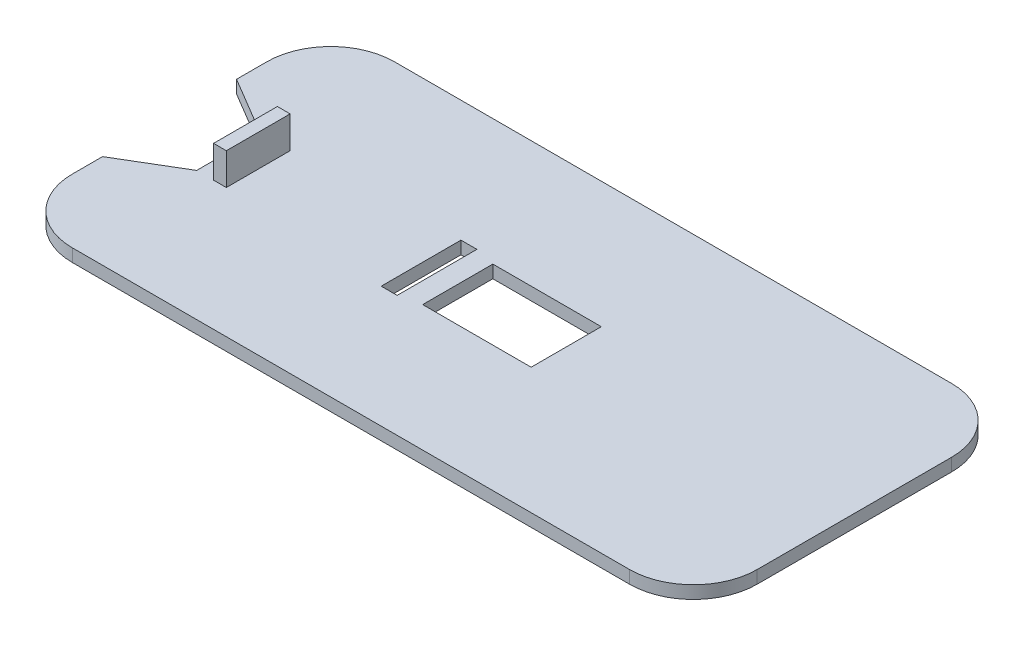
ISO-10303-21;
HEADER;
FILE_DESCRIPTION(('STEP AP214'),'2;1');
FILE_NAME('part.step','',(''),(''),'','','');
FILE_SCHEMA(('AUTOMOTIVE_DESIGN { 1 0 10303 214 1 1 1 1 }'));
ENDSEC;
DATA;
#1=APPLICATION_CONTEXT('core data for automotive mechanical design processes');
#2=APPLICATION_PROTOCOL_DEFINITION('international standard','automotive_design',2000,#1);
#3=PRODUCT_CONTEXT('',#1,'mechanical');
#4=PRODUCT('Part','Part','',(#3));
#5=PRODUCT_RELATED_PRODUCT_CATEGORY('part','',(#4));
#6=PRODUCT_DEFINITION_FORMATION('','',#4);
#7=PRODUCT_DEFINITION_CONTEXT('part definition',#1,'design');
#8=PRODUCT_DEFINITION('design','',#6,#7);
#9=PRODUCT_DEFINITION_SHAPE('','',#8);
#10=(LENGTH_UNIT() NAMED_UNIT(*) SI_UNIT(.MILLI.,.METRE.));
#11=(NAMED_UNIT(*) PLANE_ANGLE_UNIT() SI_UNIT($,.RADIAN.));
#12=(NAMED_UNIT(*) SI_UNIT($,.STERADIAN.) SOLID_ANGLE_UNIT());
#13=UNCERTAINTY_MEASURE_WITH_UNIT(LENGTH_MEASURE(1.E-05),#10,'distance_accuracy_value','');
#14=(GEOMETRIC_REPRESENTATION_CONTEXT(3) GLOBAL_UNCERTAINTY_ASSIGNED_CONTEXT((#13)) GLOBAL_UNIT_ASSIGNED_CONTEXT((#10,
#11,#12)) REPRESENTATION_CONTEXT('',''));
#15=CARTESIAN_POINT('',(0.,0.,0.));
#16=DIRECTION('',(0.,0.,1.));
#17=DIRECTION('',(1.,0.,0.));
#18=AXIS2_PLACEMENT_3D('',#15,#16,#17);
#19=CARTESIAN_POINT('',(0.,4.,0.));
#20=DIRECTION('',(0.,1.,0.));
#21=DIRECTION('',(0.,0.,1.));
#22=AXIS2_PLACEMENT_3D('',#19,#20,#21);
#23=PLANE('',#22);
#24=DIRECTION('',(0.,0.,1.));
#25=VECTOR('',#24,1.);
#26=CARTESIAN_POINT('',(165.120150391339,4.,-118.252283773647));
#27=LINE('',#26,#25);
#28=CARTESIAN_POINT('',(165.120150391339,4.,-143.252283773647));
#29=VERTEX_POINT('',#28);
#30=CARTESIAN_POINT('',(165.120150391339,4.,-118.252283773647));
#31=VERTEX_POINT('',#30);
#32=EDGE_CURVE('E221',#29,#31,#27,.T.);
#33=ORIENTED_EDGE('',*,*,#32,.T.);
#34=DIRECTION('',(-1.,0.,0.));
#35=VECTOR('',#34,1.);
#36=CARTESIAN_POINT('',(160.120150391339,4.,-118.252283773647));
#37=LINE('',#36,#35);
#38=CARTESIAN_POINT('',(160.120150391339,4.,-118.252283773647));
#39=VERTEX_POINT('',#38);
#40=EDGE_CURVE('E230',#31,#39,#37,.T.);
#41=ORIENTED_EDGE('',*,*,#40,.T.);
#42=DIRECTION('',(0.,0.,-1.));
#43=VECTOR('',#42,1.);
#44=CARTESIAN_POINT('',(160.120150391339,4.,-118.252283773647));
#45=LINE('',#44,#43);
#46=CARTESIAN_POINT('',(160.120150391339,4.,-143.252283773647));
#47=VERTEX_POINT('',#46);
#48=EDGE_CURVE('E49',#39,#47,#45,.T.);
#49=ORIENTED_EDGE('',*,*,#48,.T.);
#50=DIRECTION('',(1.,0.,0.));
#51=VECTOR('',#50,1.);
#52=CARTESIAN_POINT('',(160.120150391339,4.,-143.252283773647));
#53=LINE('',#52,#51);
#54=EDGE_CURVE('E227',#47,#29,#53,.T.);
#55=ORIENTED_EDGE('',*,*,#54,.T.);
#56=EDGE_LOOP('',(#33,#41,#49,#55));
#57=FACE_BOUND('',#56,.T.);
#58=DIRECTION('',(-0.859535888020659,0.,-0.511075392877155));
#59=VECTOR('',#58,1.);
#60=CARTESIAN_POINT('',(99.770150391339,4.,-140.752283773647));
#61=LINE('',#60,#59);
#62=CARTESIAN_POINT('',(99.770150391339,4.,-140.752283773647));
#63=VERTEX_POINT('',#62);
#64=CARTESIAN_POINT('',(81.270150391339,4.,-151.752283773647));
#65=VERTEX_POINT('',#64);
#66=EDGE_CURVE('E302',#63,#65,#61,.T.);
#67=ORIENTED_EDGE('',*,*,#66,.F.);
#68=DIRECTION('',(0.,0.,-1.));
#69=VECTOR('',#68,1.);
#70=CARTESIAN_POINT('',(99.770150391339,4.,-120.752283773647));
#71=LINE('',#70,#69);
#72=CARTESIAN_POINT('',(99.770150391339,4.,-120.752283773647));
#73=VERTEX_POINT('',#72);
#74=EDGE_CURVE('E307',#73,#63,#71,.T.);
#75=ORIENTED_EDGE('',*,*,#74,.F.);
#76=DIRECTION('',(0.859535888020664,0.,-0.511075392877145));
#77=VECTOR('',#76,1.);
#78=CARTESIAN_POINT('',(81.270150391339,4.,-109.752283773647));
#79=LINE('',#78,#77);
#80=CARTESIAN_POINT('',(81.270150391339,4.,-109.752283773647));
#81=VERTEX_POINT('',#80);
#82=EDGE_CURVE('E315',#81,#73,#79,.T.);
#83=ORIENTED_EDGE('',*,*,#82,.F.);
#84=DIRECTION('',(0.,0.,1.));
#85=VECTOR('',#84,1.);
#86=CARTESIAN_POINT('',(81.270150391339,4.,0.));
#87=LINE('',#86,#85);
#88=CARTESIAN_POINT('',(81.270150391339,4.,-100.252283773648));
#89=VERTEX_POINT('',#88);
#90=EDGE_CURVE('E373',#81,#89,#87,.T.);
#91=ORIENTED_EDGE('',*,*,#90,.T.);
#92=CARTESIAN_POINT('',(101.270150391339,4.,-100.252283773647));
#93=DIRECTION('',(0.,1.,0.));
#94=DIRECTION('',(0.,0.,1.));
#95=AXIS2_PLACEMENT_3D('',#92,#93,#94);
#96=CIRCLE('',#95,20.);
#97=CARTESIAN_POINT('',(101.270150391339,4.,-80.2522837736474));
#98=VERTEX_POINT('',#97);
#99=EDGE_CURVE('E377',#89,#98,#96,.T.);
#100=ORIENTED_EDGE('',*,*,#99,.T.);
#101=DIRECTION('',(1.,0.,0.));
#102=VECTOR('',#101,1.);
#103=CARTESIAN_POINT('',(0.,4.,-80.2522837736474));
#104=LINE('',#103,#102);
#105=CARTESIAN_POINT('',(275.970150391339,4.,-80.2522837736474));
#106=VERTEX_POINT('',#105);
#107=EDGE_CURVE('E379',#98,#106,#104,.T.);
#108=ORIENTED_EDGE('',*,*,#107,.T.);
#109=CARTESIAN_POINT('',(275.970150391339,4.,-100.252283773647));
#110=DIRECTION('',(0.,1.,0.));
#111=DIRECTION('',(0.,0.,1.));
#112=AXIS2_PLACEMENT_3D('',#109,#110,#111);
#113=CIRCLE('',#112,20.);
#114=CARTESIAN_POINT('',(295.970150391339,4.,-100.252283773647));
#115=VERTEX_POINT('',#114);
#116=EDGE_CURVE('E381',#106,#115,#113,.T.);
#117=ORIENTED_EDGE('',*,*,#116,.T.);
#118=DIRECTION('',(0.,0.,1.));
#119=VECTOR('',#118,1.);
#120=CARTESIAN_POINT('',(295.970150391339,4.,0.));
#121=LINE('',#120,#119);
#122=CARTESIAN_POINT('',(295.970150391339,4.,-161.252283773647));
#123=VERTEX_POINT('',#122);
#124=EDGE_CURVE('E361',#123,#115,#121,.T.);
#125=ORIENTED_EDGE('',*,*,#124,.F.);
#126=CARTESIAN_POINT('',(275.970150391339,4.,-161.252283773647));
#127=DIRECTION('',(0.,1.,0.));
#128=DIRECTION('',(0.,0.,1.));
#129=AXIS2_PLACEMENT_3D('',#126,#127,#128);
#130=CIRCLE('',#129,20.);
#131=CARTESIAN_POINT('',(275.970150391339,4.,-181.252283773647));
#132=VERTEX_POINT('',#131);
#133=EDGE_CURVE('E364',#132,#123,#130,.F.);
#134=ORIENTED_EDGE('',*,*,#133,.F.);
#135=DIRECTION('',(1.,0.,0.));
#136=VECTOR('',#135,1.);
#137=CARTESIAN_POINT('',(0.,4.,-181.252283773647));
#138=LINE('',#137,#136);
#139=CARTESIAN_POINT('',(101.270150391339,4.,-181.252283773647));
#140=VERTEX_POINT('',#139);
#141=EDGE_CURVE('E368',#140,#132,#138,.T.);
#142=ORIENTED_EDGE('',*,*,#141,.F.);
#143=CARTESIAN_POINT('',(101.270150391339,4.,-161.252283773647));
#144=DIRECTION('',(0.,1.,0.));
#145=DIRECTION('',(0.,0.,1.));
#146=AXIS2_PLACEMENT_3D('',#143,#144,#145);
#147=CIRCLE('',#146,20.);
#148=CARTESIAN_POINT('',(81.270150391339,4.,-161.252283773647));
#149=VERTEX_POINT('',#148);
#150=EDGE_CURVE('E371',#140,#149,#147,.T.);
#151=ORIENTED_EDGE('',*,*,#150,.T.);
#152=EDGE_CURVE('E374',#149,#65,#87,.T.);
#153=ORIENTED_EDGE('',*,*,#152,.T.);
#154=EDGE_LOOP('',(#67,#75,#83,#91,#100,#108,#117,#125,#134,#142,#151,#153));
#155=FACE_BOUND('',#154,.T.);
#156=DIRECTION('',(0.,0.,1.));
#157=VECTOR('',#156,1.);
#158=CARTESIAN_POINT('',(171.620150391339,4.,-141.752283773647));
#159=LINE('',#158,#157);
#160=CARTESIAN_POINT('',(171.620150391339,4.,-141.752283773647));
#161=VERTEX_POINT('',#160);
#162=CARTESIAN_POINT('',(171.620150391339,4.,-119.752283773647));
#163=VERTEX_POINT('',#162);
#164=EDGE_CURVE('E332',#161,#163,#159,.T.);
#165=ORIENTED_EDGE('',*,*,#164,.F.);
#166=DIRECTION('',(1.,0.,0.));
#167=VECTOR('',#166,1.);
#168=CARTESIAN_POINT('',(171.620150391339,4.,-141.752283773647));
#169=LINE('',#168,#167);
#170=CARTESIAN_POINT('',(205.620150391339,4.,-141.752283773647));
#171=VERTEX_POINT('',#170);
#172=EDGE_CURVE('E322',#161,#171,#169,.T.);
#173=ORIENTED_EDGE('',*,*,#172,.T.);
#174=DIRECTION('',(0.,0.,1.));
#175=VECTOR('',#174,1.);
#176=CARTESIAN_POINT('',(205.620150391339,4.,-141.752283773647));
#177=LINE('',#176,#175);
#178=CARTESIAN_POINT('',(205.620150391339,4.,-119.752283773647));
#179=VERTEX_POINT('',#178);
#180=EDGE_CURVE('E343',#171,#179,#177,.T.);
#181=ORIENTED_EDGE('',*,*,#180,.T.);
#182=DIRECTION('',(1.,0.,0.));
#183=VECTOR('',#182,1.);
#184=CARTESIAN_POINT('',(171.620150391339,4.,-119.752283773647));
#185=LINE('',#184,#183);
#186=EDGE_CURVE('E346',#163,#179,#185,.T.);
#187=ORIENTED_EDGE('',*,*,#186,.F.);
#188=EDGE_LOOP('',(#165,#173,#181,#187));
#189=FACE_BOUND('',#188,.T.);
#190=DIRECTION('',(1.,0.,0.));
#191=VECTOR('',#190,1.);
#192=CARTESIAN_POINT('',(0.,4.,-140.752283773647));
#193=LINE('',#192,#191);
#194=CARTESIAN_POINT('',(105.070150391339,4.,-140.752283773647));
#195=VERTEX_POINT('',#194);
#196=CARTESIAN_POINT('',(109.070150391339,4.,-140.752283773647));
#197=VERTEX_POINT('',#196);
#198=EDGE_CURVE('E296',#195,#197,#193,.T.);
#199=ORIENTED_EDGE('',*,*,#198,.T.);
#200=DIRECTION('',(0.,0.,1.));
#201=VECTOR('',#200,1.);
#202=CARTESIAN_POINT('',(109.070150391339,4.,0.));
#203=LINE('',#202,#201);
#204=CARTESIAN_POINT('',(109.070150391339,4.,-120.752283773647));
#205=VERTEX_POINT('',#204);
#206=EDGE_CURVE('E299',#197,#205,#203,.T.);
#207=ORIENTED_EDGE('',*,*,#206,.T.);
#208=DIRECTION('',(-1.,0.,0.));
#209=VECTOR('',#208,1.);
#210=CARTESIAN_POINT('',(0.,4.,-120.752283773647));
#211=LINE('',#210,#209);
#212=CARTESIAN_POINT('',(105.070150391339,4.,-120.752283773647));
#213=VERTEX_POINT('',#212);
#214=EDGE_CURVE('E290',#205,#213,#211,.T.);
#215=ORIENTED_EDGE('',*,*,#214,.T.);
#216=DIRECTION('',(0.,0.,-1.));
#217=VECTOR('',#216,1.);
#218=CARTESIAN_POINT('',(105.070150391339,4.,0.));
#219=LINE('',#218,#217);
#220=EDGE_CURVE('E293',#213,#195,#219,.T.);
#221=ORIENTED_EDGE('',*,*,#220,.T.);
#222=EDGE_LOOP('',(#199,#207,#215,#221));
#223=FACE_BOUND('',#222,.T.);
#224=ADVANCED_FACE('F34',(#57,#155,#189,#223),#23,.T.);
#225=CARTESIAN_POINT('',(0.,0.,0.));
#226=DIRECTION('',(0.,1.,0.));
#227=DIRECTION('',(0.,0.,1.));
#228=AXIS2_PLACEMENT_3D('',#225,#226,#227);
#229=PLANE('',#228);
#230=DIRECTION('',(-1.,0.,0.));
#231=VECTOR('',#230,1.);
#232=CARTESIAN_POINT('',(160.120150391339,0.,-118.252283773647));
#233=LINE('',#232,#231);
#234=CARTESIAN_POINT('',(165.120150391339,0.,-118.252283773647));
#235=VERTEX_POINT('',#234);
#236=CARTESIAN_POINT('',(160.120150391339,0.,-118.252283773647));
#237=VERTEX_POINT('',#236);
#238=EDGE_CURVE('E245',#235,#237,#233,.T.);
#239=ORIENTED_EDGE('',*,*,#238,.F.);
#240=DIRECTION('',(0.,0.,1.));
#241=VECTOR('',#240,1.);
#242=CARTESIAN_POINT('',(165.120150391339,0.,-118.252283773647));
#243=LINE('',#242,#241);
#244=CARTESIAN_POINT('',(165.120150391339,0.,-143.252283773647));
#245=VERTEX_POINT('',#244);
#246=EDGE_CURVE('E57',#245,#235,#243,.T.);
#247=ORIENTED_EDGE('',*,*,#246,.F.);
#248=DIRECTION('',(1.,0.,0.));
#249=VECTOR('',#248,1.);
#250=CARTESIAN_POINT('',(160.120150391339,0.,-143.252283773647));
#251=LINE('',#250,#249);
#252=CARTESIAN_POINT('',(160.120150391339,0.,-143.252283773647));
#253=VERTEX_POINT('',#252);
#254=EDGE_CURVE('E236',#253,#245,#251,.T.);
#255=ORIENTED_EDGE('',*,*,#254,.F.);
#256=DIRECTION('',(0.,0.,-1.));
#257=VECTOR('',#256,1.);
#258=CARTESIAN_POINT('',(160.120150391339,0.,-118.252283773647));
#259=LINE('',#258,#257);
#260=EDGE_CURVE('E239',#237,#253,#259,.T.);
#261=ORIENTED_EDGE('',*,*,#260,.F.);
#262=EDGE_LOOP('',(#239,#247,#255,#261));
#263=FACE_BOUND('',#262,.T.);
#264=DIRECTION('',(1.,0.,0.));
#265=VECTOR('',#264,1.);
#266=CARTESIAN_POINT('',(171.620150391339,0.,-141.752283773647));
#267=LINE('',#266,#265);
#268=CARTESIAN_POINT('',(171.620150391339,0.,-141.752283773647));
#269=VERTEX_POINT('',#268);
#270=CARTESIAN_POINT('',(205.620150391339,0.,-141.752283773647));
#271=VERTEX_POINT('',#270);
#272=EDGE_CURVE('E329',#269,#271,#267,.T.);
#273=ORIENTED_EDGE('',*,*,#272,.F.);
#274=DIRECTION('',(0.,0.,1.));
#275=VECTOR('',#274,1.);
#276=CARTESIAN_POINT('',(171.620150391339,0.,-141.752283773647));
#277=LINE('',#276,#275);
#278=CARTESIAN_POINT('',(171.620150391339,0.,-119.752283773647));
#279=VERTEX_POINT('',#278);
#280=EDGE_CURVE('E337',#269,#279,#277,.T.);
#281=ORIENTED_EDGE('',*,*,#280,.T.);
#282=DIRECTION('',(1.,0.,0.));
#283=VECTOR('',#282,1.);
#284=CARTESIAN_POINT('',(171.620150391339,0.,-119.752283773647));
#285=LINE('',#284,#283);
#286=CARTESIAN_POINT('',(205.620150391339,0.,-119.752283773647));
#287=VERTEX_POINT('',#286);
#288=EDGE_CURVE('E334',#279,#287,#285,.T.);
#289=ORIENTED_EDGE('',*,*,#288,.T.);
#290=DIRECTION('',(0.,0.,1.));
#291=VECTOR('',#290,1.);
#292=CARTESIAN_POINT('',(205.620150391339,0.,-141.752283773647));
#293=LINE('',#292,#291);
#294=EDGE_CURVE('E331',#271,#287,#293,.T.);
#295=ORIENTED_EDGE('',*,*,#294,.F.);
#296=EDGE_LOOP('',(#273,#281,#289,#295));
#297=FACE_BOUND('',#296,.T.);
#298=DIRECTION('',(0.,0.,-1.));
#299=VECTOR('',#298,1.);
#300=CARTESIAN_POINT('',(99.770150391339,0.,-120.752283773647));
#301=LINE('',#300,#299);
#302=CARTESIAN_POINT('',(99.770150391339,0.,-120.752283773647));
#303=VERTEX_POINT('',#302);
#304=CARTESIAN_POINT('',(99.770150391339,0.,-140.752283773647));
#305=VERTEX_POINT('',#304);
#306=EDGE_CURVE('E310',#303,#305,#301,.T.);
#307=ORIENTED_EDGE('',*,*,#306,.T.);
#308=DIRECTION('',(-0.859535888020659,0.,-0.511075392877155));
#309=VECTOR('',#308,1.);
#310=CARTESIAN_POINT('',(99.770150391339,0.,-140.752283773647));
#311=LINE('',#310,#309);
#312=CARTESIAN_POINT('',(81.270150391339,0.,-151.752283773647));
#313=VERTEX_POINT('',#312);
#314=EDGE_CURVE('E303',#305,#313,#311,.T.);
#315=ORIENTED_EDGE('',*,*,#314,.T.);
#316=DIRECTION('',(0.,0.,1.));
#317=VECTOR('',#316,1.);
#318=CARTESIAN_POINT('',(81.270150391339,0.,0.));
#319=LINE('',#318,#317);
#320=CARTESIAN_POINT('',(81.270150391339,0.,-161.252283773647));
#321=VERTEX_POINT('',#320);
#322=EDGE_CURVE('E395',#321,#313,#319,.T.);
#323=ORIENTED_EDGE('',*,*,#322,.F.);
#324=CARTESIAN_POINT('',(101.270150391339,0.,-161.252283773647));
#325=DIRECTION('',(0.,1.,0.));
#326=DIRECTION('',(0.,0.,1.));
#327=AXIS2_PLACEMENT_3D('',#324,#325,#326);
#328=CIRCLE('',#327,20.);
#329=CARTESIAN_POINT('',(101.270150391339,0.,-181.252283773647));
#330=VERTEX_POINT('',#329);
#331=EDGE_CURVE('E392',#330,#321,#328,.T.);
#332=ORIENTED_EDGE('',*,*,#331,.F.);
#333=DIRECTION('',(1.,0.,0.));
#334=VECTOR('',#333,1.);
#335=CARTESIAN_POINT('',(0.,0.,-181.252283773647));
#336=LINE('',#335,#334);
#337=CARTESIAN_POINT('',(275.970150391339,0.,-181.252283773647));
#338=VERTEX_POINT('',#337);
#339=EDGE_CURVE('E389',#330,#338,#336,.T.);
#340=ORIENTED_EDGE('',*,*,#339,.T.);
#341=CARTESIAN_POINT('',(275.970150391339,0.,-161.252283773647));
#342=DIRECTION('',(0.,1.,0.));
#343=DIRECTION('',(0.,0.,1.));
#344=AXIS2_PLACEMENT_3D('',#341,#342,#343);
#345=CIRCLE('',#344,20.);
#346=CARTESIAN_POINT('',(295.970150391339,0.,-161.252283773647));
#347=VERTEX_POINT('',#346);
#348=EDGE_CURVE('E386',#338,#347,#345,.F.);
#349=ORIENTED_EDGE('',*,*,#348,.T.);
#350=DIRECTION('',(0.,0.,1.));
#351=VECTOR('',#350,1.);
#352=CARTESIAN_POINT('',(295.970150391339,0.,0.));
#353=LINE('',#352,#351);
#354=CARTESIAN_POINT('',(295.970150391339,0.,-100.252283773647));
#355=VERTEX_POINT('',#354);
#356=EDGE_CURVE('E360',#347,#355,#353,.T.);
#357=ORIENTED_EDGE('',*,*,#356,.T.);
#358=CARTESIAN_POINT('',(275.970150391339,0.,-100.252283773647));
#359=DIRECTION('',(0.,1.,0.));
#360=DIRECTION('',(0.,0.,1.));
#361=AXIS2_PLACEMENT_3D('',#358,#359,#360);
#362=CIRCLE('',#361,20.);
#363=CARTESIAN_POINT('',(275.970150391339,0.,-80.2522837736474));
#364=VERTEX_POINT('',#363);
#365=EDGE_CURVE('E365',#364,#355,#362,.T.);
#366=ORIENTED_EDGE('',*,*,#365,.F.);
#367=DIRECTION('',(1.,0.,0.));
#368=VECTOR('',#367,1.);
#369=CARTESIAN_POINT('',(0.,0.,-80.2522837736474));
#370=LINE('',#369,#368);
#371=CARTESIAN_POINT('',(101.270150391339,0.,-80.2522837736474));
#372=VERTEX_POINT('',#371);
#373=EDGE_CURVE('E400',#372,#364,#370,.T.);
#374=ORIENTED_EDGE('',*,*,#373,.F.);
#375=CARTESIAN_POINT('',(101.270150391339,0.,-100.252283773647));
#376=DIRECTION('',(0.,1.,0.));
#377=DIRECTION('',(0.,0.,1.));
#378=AXIS2_PLACEMENT_3D('',#375,#376,#377);
#379=CIRCLE('',#378,20.);
#380=CARTESIAN_POINT('',(81.270150391339,0.,-100.252283773648));
#381=VERTEX_POINT('',#380);
#382=EDGE_CURVE('E398',#381,#372,#379,.T.);
#383=ORIENTED_EDGE('',*,*,#382,.F.);
#384=CARTESIAN_POINT('',(81.270150391339,0.,-109.752283773647));
#385=VERTEX_POINT('',#384);
#386=EDGE_CURVE('E394',#385,#381,#319,.T.);
#387=ORIENTED_EDGE('',*,*,#386,.F.);
#388=DIRECTION('',(0.859535888020664,0.,-0.511075392877145));
#389=VECTOR('',#388,1.);
#390=CARTESIAN_POINT('',(81.270150391339,0.,-109.752283773647));
#391=LINE('',#390,#389);
#392=EDGE_CURVE('E306',#385,#303,#391,.T.);
#393=ORIENTED_EDGE('',*,*,#392,.T.);
#394=EDGE_LOOP('',(#307,#315,#323,#332,#340,#349,#357,#366,#374,#383,#387,#393));
#395=FACE_BOUND('',#394,.T.);
#396=DIRECTION('',(0.,0.,1.));
#397=VECTOR('',#396,1.);
#398=CARTESIAN_POINT('',(109.070150391339,0.,0.));
#399=LINE('',#398,#397);
#400=CARTESIAN_POINT('',(109.070150391339,0.,-140.752283773647));
#401=VERTEX_POINT('',#400);
#402=CARTESIAN_POINT('',(109.070150391339,0.,-120.752283773647));
#403=VERTEX_POINT('',#402);
#404=EDGE_CURVE('E11',#401,#403,#399,.T.);
#405=ORIENTED_EDGE('',*,*,#404,.F.);
#406=DIRECTION('',(1.,0.,0.));
#407=VECTOR('',#406,1.);
#408=CARTESIAN_POINT('',(0.,0.,-140.752283773647));
#409=LINE('',#408,#407);
#410=CARTESIAN_POINT('',(105.070150391339,0.,-140.752283773647));
#411=VERTEX_POINT('',#410);
#412=EDGE_CURVE('E42',#411,#401,#409,.T.);
#413=ORIENTED_EDGE('',*,*,#412,.F.);
#414=DIRECTION('',(0.,0.,-1.));
#415=VECTOR('',#414,1.);
#416=CARTESIAN_POINT('',(105.070150391339,0.,0.));
#417=LINE('',#416,#415);
#418=CARTESIAN_POINT('',(105.070150391339,0.,-120.752283773647));
#419=VERTEX_POINT('',#418);
#420=EDGE_CURVE('E426',#419,#411,#417,.T.);
#421=ORIENTED_EDGE('',*,*,#420,.F.);
#422=DIRECTION('',(-1.,0.,0.));
#423=VECTOR('',#422,1.);
#424=CARTESIAN_POINT('',(0.,0.,-120.752283773647));
#425=LINE('',#424,#423);
#426=EDGE_CURVE('E423',#403,#419,#425,.T.);
#427=ORIENTED_EDGE('',*,*,#426,.F.);
#428=EDGE_LOOP('',(#405,#413,#421,#427));
#429=FACE_BOUND('',#428,.T.);
#430=ADVANCED_FACE('F448',(#263,#297,#395,#429),#229,.F.);
#431=CARTESIAN_POINT('',(81.270150391339,4.,0.));
#432=DIRECTION('',(1.,0.,0.));
#433=DIRECTION('',(0.,0.,-1.));
#434=AXIS2_PLACEMENT_3D('',#431,#432,#433);
#435=PLANE('',#434);
#436=ORIENTED_EDGE('',*,*,#322,.T.);
#437=DIRECTION('',(0.,1.,0.));
#438=VECTOR('',#437,1.);
#439=CARTESIAN_POINT('',(81.270150391339,0.,-151.752283773647));
#440=LINE('',#439,#438);
#441=EDGE_CURVE('E313',#313,#65,#440,.T.);
#442=ORIENTED_EDGE('',*,*,#441,.T.);
#443=ORIENTED_EDGE('',*,*,#152,.F.);
#444=DIRECTION('',(0.,-1.,0.));
#445=VECTOR('',#444,1.);
#446=CARTESIAN_POINT('',(81.270150391339,4.,-161.252283773647));
#447=LINE('',#446,#445);
#448=EDGE_CURVE('E414',#149,#321,#447,.T.);
#449=ORIENTED_EDGE('',*,*,#448,.T.);
#450=EDGE_LOOP('',(#436,#442,#443,#449));
#451=FACE_BOUND('',#450,.T.);
#452=ADVANCED_FACE('F450',(#451),#435,.F.);
#453=CARTESIAN_POINT('',(295.970150391339,4.,0.));
#454=DIRECTION('',(1.,0.,0.));
#455=DIRECTION('',(0.,0.,-1.));
#456=AXIS2_PLACEMENT_3D('',#453,#454,#455);
#457=PLANE('',#456);
#458=ORIENTED_EDGE('',*,*,#356,.F.);
#459=DIRECTION('',(0.,-1.,0.));
#460=VECTOR('',#459,1.);
#461=CARTESIAN_POINT('',(295.970150391339,4.,-161.252283773647));
#462=LINE('',#461,#460);
#463=EDGE_CURVE('E421',#123,#347,#462,.T.);
#464=ORIENTED_EDGE('',*,*,#463,.F.);
#465=ORIENTED_EDGE('',*,*,#124,.T.);
#466=DIRECTION('',(0.,-1.,0.));
#467=VECTOR('',#466,1.);
#468=CARTESIAN_POINT('',(295.970150391339,4.,-100.252283773647));
#469=LINE('',#468,#467);
#470=EDGE_CURVE('E383',#115,#355,#469,.T.);
#471=ORIENTED_EDGE('',*,*,#470,.T.);
#472=EDGE_LOOP('',(#458,#464,#465,#471));
#473=FACE_BOUND('',#472,.T.);
#474=ADVANCED_FACE('F36',(#473),#457,.T.);
#475=CARTESIAN_POINT('',(275.970150391339,4.,-161.252283773647));
#476=DIRECTION('',(0.,-1.,0.));
#477=DIRECTION('',(0.,0.,-1.));
#478=AXIS2_PLACEMENT_3D('',#475,#476,#477);
#479=CYLINDRICAL_SURFACE('',#478,20.);
#480=ORIENTED_EDGE('',*,*,#348,.F.);
#481=DIRECTION('',(0.,-1.,0.));
#482=VECTOR('',#481,1.);
#483=CARTESIAN_POINT('',(275.970150391339,4.,-181.252283773647));
#484=LINE('',#483,#482);
#485=EDGE_CURVE('E419',#132,#338,#484,.T.);
#486=ORIENTED_EDGE('',*,*,#485,.F.);
#487=ORIENTED_EDGE('',*,*,#133,.T.);
#488=ORIENTED_EDGE('',*,*,#463,.T.);
#489=EDGE_LOOP('',(#480,#486,#487,#488));
#490=FACE_BOUND('',#489,.T.);
#491=ADVANCED_FACE('F485',(#490),#479,.T.);
#492=CARTESIAN_POINT('',(0.,4.,-181.252283773647));
#493=DIRECTION('',(0.,0.,-1.));
#494=DIRECTION('',(-1.,0.,0.));
#495=AXIS2_PLACEMENT_3D('',#492,#493,#494);
#496=PLANE('',#495);
#497=ORIENTED_EDGE('',*,*,#339,.F.);
#498=DIRECTION('',(0.,-1.,0.));
#499=VECTOR('',#498,1.);
#500=CARTESIAN_POINT('',(101.270150391339,4.,-181.252283773647));
#501=LINE('',#500,#499);
#502=EDGE_CURVE('E417',#140,#330,#501,.T.);
#503=ORIENTED_EDGE('',*,*,#502,.F.);
#504=ORIENTED_EDGE('',*,*,#141,.T.);
#505=ORIENTED_EDGE('',*,*,#485,.T.);
#506=EDGE_LOOP('',(#497,#503,#504,#505));
#507=FACE_BOUND('',#506,.T.);
#508=ADVANCED_FACE('F482',(#507),#496,.T.);
#509=CARTESIAN_POINT('',(101.270150391339,4.,-161.252283773647));
#510=DIRECTION('',(0.,-1.,0.));
#511=DIRECTION('',(0.,0.,-1.));
#512=AXIS2_PLACEMENT_3D('',#509,#510,#511);
#513=CYLINDRICAL_SURFACE('',#512,20.);
#514=ORIENTED_EDGE('',*,*,#331,.T.);
#515=ORIENTED_EDGE('',*,*,#448,.F.);
#516=ORIENTED_EDGE('',*,*,#150,.F.);
#517=ORIENTED_EDGE('',*,*,#502,.T.);
#518=EDGE_LOOP('',(#514,#515,#516,#517));
#519=FACE_BOUND('',#518,.T.);
#520=ADVANCED_FACE('F478',(#519),#513,.T.);
#521=ORIENTED_EDGE('',*,*,#90,.F.);
#522=DIRECTION('',(0.,1.,0.));
#523=VECTOR('',#522,1.);
#524=CARTESIAN_POINT('',(81.270150391339,0.,-109.752283773647));
#525=LINE('',#524,#523);
#526=EDGE_CURVE('E325',#385,#81,#525,.T.);
#527=ORIENTED_EDGE('',*,*,#526,.F.);
#528=ORIENTED_EDGE('',*,*,#386,.T.);
#529=DIRECTION('',(0.,-1.,0.));
#530=VECTOR('',#529,1.);
#531=CARTESIAN_POINT('',(81.270150391339,4.,-100.252283773648));
#532=LINE('',#531,#530);
#533=EDGE_CURVE('E411',#89,#381,#532,.T.);
#534=ORIENTED_EDGE('',*,*,#533,.F.);
#535=EDGE_LOOP('',(#521,#527,#528,#534));
#536=FACE_BOUND('',#535,.T.);
#537=ADVANCED_FACE('F459',(#536),#435,.F.);
#538=CARTESIAN_POINT('',(101.270150391339,4.,-100.252283773647));
#539=DIRECTION('',(0.,-1.,0.));
#540=DIRECTION('',(0.,0.,-1.));
#541=AXIS2_PLACEMENT_3D('',#538,#539,#540);
#542=CYLINDRICAL_SURFACE('',#541,20.);
#543=ORIENTED_EDGE('',*,*,#382,.T.);
#544=DIRECTION('',(0.,-1.,0.));
#545=VECTOR('',#544,1.);
#546=CARTESIAN_POINT('',(101.270150391339,4.,-80.2522837736474));
#547=LINE('',#546,#545);
#548=EDGE_CURVE('E408',#98,#372,#547,.T.);
#549=ORIENTED_EDGE('',*,*,#548,.F.);
#550=ORIENTED_EDGE('',*,*,#99,.F.);
#551=ORIENTED_EDGE('',*,*,#533,.T.);
#552=EDGE_LOOP('',(#543,#549,#550,#551));
#553=FACE_BOUND('',#552,.T.);
#554=ADVANCED_FACE('F472',(#553),#542,.T.);
#555=CARTESIAN_POINT('',(0.,4.,-80.2522837736474));
#556=DIRECTION('',(0.,0.,-1.));
#557=DIRECTION('',(-1.,0.,0.));
#558=AXIS2_PLACEMENT_3D('',#555,#556,#557);
#559=PLANE('',#558);
#560=ORIENTED_EDGE('',*,*,#373,.T.);
#561=DIRECTION('',(0.,-1.,0.));
#562=VECTOR('',#561,1.);
#563=CARTESIAN_POINT('',(275.970150391339,4.,-80.2522837736474));
#564=LINE('',#563,#562);
#565=EDGE_CURVE('E405',#106,#364,#564,.T.);
#566=ORIENTED_EDGE('',*,*,#565,.F.);
#567=ORIENTED_EDGE('',*,*,#107,.F.);
#568=ORIENTED_EDGE('',*,*,#548,.T.);
#569=EDGE_LOOP('',(#560,#566,#567,#568));
#570=FACE_BOUND('',#569,.T.);
#571=ADVANCED_FACE('F468',(#570),#559,.F.);
#572=CARTESIAN_POINT('',(275.970150391339,4.,-100.252283773647));
#573=DIRECTION('',(0.,-1.,0.));
#574=DIRECTION('',(0.,0.,-1.));
#575=AXIS2_PLACEMENT_3D('',#572,#573,#574);
#576=CYLINDRICAL_SURFACE('',#575,20.);
#577=ORIENTED_EDGE('',*,*,#365,.T.);
#578=ORIENTED_EDGE('',*,*,#470,.F.);
#579=ORIENTED_EDGE('',*,*,#116,.F.);
#580=ORIENTED_EDGE('',*,*,#565,.T.);
#581=EDGE_LOOP('',(#577,#578,#579,#580));
#582=FACE_BOUND('',#581,.T.);
#583=ADVANCED_FACE('F464',(#582),#576,.T.);
#584=CARTESIAN_POINT('',(171.620150391339,0.,-141.752283773647));
#585=DIRECTION('',(0.,0.,1.));
#586=DIRECTION('',(1.,0.,0.));
#587=AXIS2_PLACEMENT_3D('',#584,#585,#586);
#588=PLANE('',#587);
#589=ORIENTED_EDGE('',*,*,#172,.F.);
#590=DIRECTION('',(0.,1.,0.));
#591=VECTOR('',#590,1.);
#592=CARTESIAN_POINT('',(171.620150391339,0.,-141.752283773647));
#593=LINE('',#592,#591);
#594=EDGE_CURVE('E340',#269,#161,#593,.T.);
#595=ORIENTED_EDGE('',*,*,#594,.F.);
#596=ORIENTED_EDGE('',*,*,#272,.T.);
#597=DIRECTION('',(0.,1.,0.));
#598=VECTOR('',#597,1.);
#599=CARTESIAN_POINT('',(205.620150391339,0.,-141.752283773647));
#600=LINE('',#599,#598);
#601=EDGE_CURVE('E357',#271,#171,#600,.T.);
#602=ORIENTED_EDGE('',*,*,#601,.T.);
#603=EDGE_LOOP('',(#589,#595,#596,#602));
#604=FACE_BOUND('',#603,.T.);
#605=ADVANCED_FACE('F467',(#604),#588,.T.);
#606=CARTESIAN_POINT('',(205.620150391339,0.,-141.752283773647));
#607=DIRECTION('',(-1.,0.,0.));
#608=DIRECTION('',(0.,0.,1.));
#609=AXIS2_PLACEMENT_3D('',#606,#607,#608);
#610=PLANE('',#609);
#611=ORIENTED_EDGE('',*,*,#180,.F.);
#612=ORIENTED_EDGE('',*,*,#601,.F.);
#613=ORIENTED_EDGE('',*,*,#294,.T.);
#614=DIRECTION('',(0.,1.,0.));
#615=VECTOR('',#614,1.);
#616=CARTESIAN_POINT('',(205.620150391339,0.,-119.752283773647));
#617=LINE('',#616,#615);
#618=EDGE_CURVE('E355',#287,#179,#617,.T.);
#619=ORIENTED_EDGE('',*,*,#618,.T.);
#620=EDGE_LOOP('',(#611,#612,#613,#619));
#621=FACE_BOUND('',#620,.T.);
#622=ADVANCED_FACE('F545',(#621),#610,.T.);
#623=CARTESIAN_POINT('',(171.620150391339,0.,-119.752283773647));
#624=DIRECTION('',(0.,0.,1.));
#625=DIRECTION('',(1.,0.,0.));
#626=AXIS2_PLACEMENT_3D('',#623,#624,#625);
#627=PLANE('',#626);
#628=ORIENTED_EDGE('',*,*,#186,.T.);
#629=ORIENTED_EDGE('',*,*,#618,.F.);
#630=ORIENTED_EDGE('',*,*,#288,.F.);
#631=DIRECTION('',(0.,1.,0.));
#632=VECTOR('',#631,1.);
#633=CARTESIAN_POINT('',(171.620150391339,0.,-119.752283773647));
#634=LINE('',#633,#632);
#635=EDGE_CURVE('E353',#279,#163,#634,.T.);
#636=ORIENTED_EDGE('',*,*,#635,.T.);
#637=EDGE_LOOP('',(#628,#629,#630,#636));
#638=FACE_BOUND('',#637,.T.);
#639=ADVANCED_FACE('F538',(#638),#627,.F.);
#640=CARTESIAN_POINT('',(171.620150391339,0.,-141.752283773647));
#641=DIRECTION('',(-1.,0.,0.));
#642=DIRECTION('',(0.,0.,1.));
#643=AXIS2_PLACEMENT_3D('',#640,#641,#642);
#644=PLANE('',#643);
#645=ORIENTED_EDGE('',*,*,#164,.T.);
#646=ORIENTED_EDGE('',*,*,#635,.F.);
#647=ORIENTED_EDGE('',*,*,#280,.F.);
#648=ORIENTED_EDGE('',*,*,#594,.T.);
#649=EDGE_LOOP('',(#645,#646,#647,#648));
#650=FACE_BOUND('',#649,.T.);
#651=ADVANCED_FACE('F531',(#650),#644,.F.);
#652=CARTESIAN_POINT('',(99.770150391339,0.,-140.752283773647));
#653=DIRECTION('',(0.511075392877155,0.,-0.859535888020659));
#654=DIRECTION('',(-0.859535888020659,0.,-0.511075392877155));
#655=AXIS2_PLACEMENT_3D('',#652,#653,#654);
#656=PLANE('',#655);
#657=ORIENTED_EDGE('',*,*,#66,.T.);
#658=ORIENTED_EDGE('',*,*,#441,.F.);
#659=ORIENTED_EDGE('',*,*,#314,.F.);
#660=DIRECTION('',(0.,1.,0.));
#661=VECTOR('',#660,1.);
#662=CARTESIAN_POINT('',(99.770150391339,0.,-140.752283773647));
#663=LINE('',#662,#661);
#664=EDGE_CURVE('E320',#305,#63,#663,.T.);
#665=ORIENTED_EDGE('',*,*,#664,.T.);
#666=EDGE_LOOP('',(#657,#658,#659,#665));
#667=FACE_BOUND('',#666,.T.);
#668=ADVANCED_FACE('F529',(#667),#656,.F.);
#669=CARTESIAN_POINT('',(99.770150391339,0.,-120.752283773647));
#670=DIRECTION('',(1.,0.,0.));
#671=DIRECTION('',(0.,0.,-1.));
#672=AXIS2_PLACEMENT_3D('',#669,#670,#671);
#673=PLANE('',#672);
#674=ORIENTED_EDGE('',*,*,#74,.T.);
#675=ORIENTED_EDGE('',*,*,#664,.F.);
#676=ORIENTED_EDGE('',*,*,#306,.F.);
#677=DIRECTION('',(0.,1.,0.));
#678=VECTOR('',#677,1.);
#679=CARTESIAN_POINT('',(99.770150391339,0.,-120.752283773647));
#680=LINE('',#679,#678);
#681=EDGE_CURVE('E323',#303,#73,#680,.T.);
#682=ORIENTED_EDGE('',*,*,#681,.T.);
#683=EDGE_LOOP('',(#674,#675,#676,#682));
#684=FACE_BOUND('',#683,.T.);
#685=ADVANCED_FACE('F524',(#684),#673,.F.);
#686=CARTESIAN_POINT('',(81.270150391339,0.,-109.752283773647));
#687=DIRECTION('',(0.511075392877145,0.,0.859535888020664));
#688=DIRECTION('',(0.859535888020664,0.,-0.511075392877145));
#689=AXIS2_PLACEMENT_3D('',#686,#687,#688);
#690=PLANE('',#689);
#691=ORIENTED_EDGE('',*,*,#82,.T.);
#692=ORIENTED_EDGE('',*,*,#681,.F.);
#693=ORIENTED_EDGE('',*,*,#392,.F.);
#694=ORIENTED_EDGE('',*,*,#526,.T.);
#695=EDGE_LOOP('',(#691,#692,#693,#694));
#696=FACE_BOUND('',#695,.T.);
#697=ADVANCED_FACE('F521',(#696),#690,.F.);
#698=CARTESIAN_POINT('',(0.,-10.,0.));
#699=DIRECTION('',(0.,1.,0.));
#700=DIRECTION('',(0.,0.,1.));
#701=AXIS2_PLACEMENT_3D('',#698,#699,#700);
#702=PLANE('',#701);
#703=DIRECTION('',(0.,0.,-1.));
#704=VECTOR('',#703,1.);
#705=CARTESIAN_POINT('',(109.070150391339,-10.,-140.752283773647));
#706=LINE('',#705,#704);
#707=CARTESIAN_POINT('',(109.070150391339,-10.,-120.752283773647));
#708=VERTEX_POINT('',#707);
#709=CARTESIAN_POINT('',(109.070150391339,-10.,-140.752283773647));
#710=VERTEX_POINT('',#709);
#711=EDGE_CURVE('E251',#708,#710,#706,.T.);
#712=ORIENTED_EDGE('',*,*,#711,.F.);
#713=DIRECTION('',(1.,0.,0.));
#714=VECTOR('',#713,1.);
#715=CARTESIAN_POINT('',(105.070150391339,-10.,-120.752283773647));
#716=LINE('',#715,#714);
#717=CARTESIAN_POINT('',(105.070150391339,-10.,-120.752283773647));
#718=VERTEX_POINT('',#717);
#719=EDGE_CURVE('E263',#718,#708,#716,.T.);
#720=ORIENTED_EDGE('',*,*,#719,.F.);
#721=DIRECTION('',(0.,0.,1.));
#722=VECTOR('',#721,1.);
#723=CARTESIAN_POINT('',(105.070150391339,-10.,-140.752283773647));
#724=LINE('',#723,#722);
#725=CARTESIAN_POINT('',(105.070150391339,-10.,-140.752283773647));
#726=VERTEX_POINT('',#725);
#727=EDGE_CURVE('E260',#726,#718,#724,.T.);
#728=ORIENTED_EDGE('',*,*,#727,.F.);
#729=DIRECTION('',(-1.,0.,0.));
#730=VECTOR('',#729,1.);
#731=CARTESIAN_POINT('',(105.070150391339,-10.,-140.752283773647));
#732=LINE('',#731,#730);
#733=EDGE_CURVE('E257',#710,#726,#732,.T.);
#734=ORIENTED_EDGE('',*,*,#733,.F.);
#735=EDGE_LOOP('',(#712,#720,#728,#734));
#736=FACE_BOUND('',#735,.T.);
#737=ADVANCED_FACE('F441',(#736),#702,.F.);
#738=CARTESIAN_POINT('',(105.070150391339,14.,-120.752283773647));
#739=DIRECTION('',(0.,0.,-1.));
#740=DIRECTION('',(-1.,0.,0.));
#741=AXIS2_PLACEMENT_3D('',#738,#739,#740);
#742=PLANE('',#741);
#743=DIRECTION('',(0.,-1.,0.));
#744=VECTOR('',#743,1.);
#745=CARTESIAN_POINT('',(109.070150391339,14.,-120.752283773647));
#746=LINE('',#745,#744);
#747=EDGE_CURVE('E275',#403,#708,#746,.T.);
#748=ORIENTED_EDGE('',*,*,#747,.F.);
#749=ORIENTED_EDGE('',*,*,#426,.T.);
#750=DIRECTION('',(0.,-1.,0.));
#751=VECTOR('',#750,1.);
#752=CARTESIAN_POINT('',(105.070150391339,14.,-120.752283773647));
#753=LINE('',#752,#751);
#754=EDGE_CURVE('E279',#419,#718,#753,.T.);
#755=ORIENTED_EDGE('',*,*,#754,.T.);
#756=ORIENTED_EDGE('',*,*,#719,.T.);
#757=EDGE_LOOP('',(#748,#749,#755,#756));
#758=FACE_BOUND('',#757,.T.);
#759=ADVANCED_FACE('F444',(#758),#742,.F.);
#760=CARTESIAN_POINT('',(105.070150391339,14.,-140.752283773647));
#761=DIRECTION('',(1.,0.,0.));
#762=DIRECTION('',(0.,0.,-1.));
#763=AXIS2_PLACEMENT_3D('',#760,#761,#762);
#764=PLANE('',#763);
#765=ORIENTED_EDGE('',*,*,#754,.F.);
#766=ORIENTED_EDGE('',*,*,#420,.T.);
#767=DIRECTION('',(0.,-1.,0.));
#768=VECTOR('',#767,1.);
#769=CARTESIAN_POINT('',(105.070150391339,14.,-140.752283773647));
#770=LINE('',#769,#768);
#771=EDGE_CURVE('E282',#411,#726,#770,.T.);
#772=ORIENTED_EDGE('',*,*,#771,.T.);
#773=ORIENTED_EDGE('',*,*,#727,.T.);
#774=EDGE_LOOP('',(#765,#766,#772,#773));
#775=FACE_BOUND('',#774,.T.);
#776=ADVANCED_FACE('F447',(#775),#764,.F.);
#777=CARTESIAN_POINT('',(105.070150391339,14.,-140.752283773647));
#778=DIRECTION('',(0.,0.,1.));
#779=DIRECTION('',(1.,0.,0.));
#780=AXIS2_PLACEMENT_3D('',#777,#778,#779);
#781=PLANE('',#780);
#782=ORIENTED_EDGE('',*,*,#771,.F.);
#783=ORIENTED_EDGE('',*,*,#412,.T.);
#784=DIRECTION('',(0.,-1.,0.));
#785=VECTOR('',#784,1.);
#786=CARTESIAN_POINT('',(109.070150391339,14.,-140.752283773647));
#787=LINE('',#786,#785);
#788=EDGE_CURVE('E286',#401,#710,#787,.T.);
#789=ORIENTED_EDGE('',*,*,#788,.T.);
#790=ORIENTED_EDGE('',*,*,#733,.T.);
#791=EDGE_LOOP('',(#782,#783,#789,#790));
#792=FACE_BOUND('',#791,.T.);
#793=ADVANCED_FACE('F432',(#792),#781,.F.);
#794=CARTESIAN_POINT('',(109.070150391339,14.,-140.752283773647));
#795=DIRECTION('',(-1.,0.,0.));
#796=DIRECTION('',(0.,0.,1.));
#797=AXIS2_PLACEMENT_3D('',#794,#795,#796);
#798=PLANE('',#797);
#799=ORIENTED_EDGE('',*,*,#788,.F.);
#800=ORIENTED_EDGE('',*,*,#404,.T.);
#801=ORIENTED_EDGE('',*,*,#747,.T.);
#802=ORIENTED_EDGE('',*,*,#711,.T.);
#803=EDGE_LOOP('',(#799,#800,#801,#802));
#804=FACE_BOUND('',#803,.T.);
#805=ADVANCED_FACE('F436',(#804),#798,.F.);
#806=ORIENTED_EDGE('',*,*,#206,.F.);
#807=CARTESIAN_POINT('',(109.070150391339,14.,-140.752283773647));
#808=VERTEX_POINT('',#807);
#809=EDGE_CURVE('E287',#808,#197,#787,.T.);
#810=ORIENTED_EDGE('',*,*,#809,.F.);
#811=DIRECTION('',(0.,0.,-1.));
#812=VECTOR('',#811,1.);
#813=CARTESIAN_POINT('',(109.070150391339,14.,-140.752283773647));
#814=LINE('',#813,#812);
#815=CARTESIAN_POINT('',(109.070150391339,14.,-120.752283773647));
#816=VERTEX_POINT('',#815);
#817=EDGE_CURVE('E266',#816,#808,#814,.T.);
#818=ORIENTED_EDGE('',*,*,#817,.F.);
#819=EDGE_CURVE('E276',#816,#205,#746,.T.);
#820=ORIENTED_EDGE('',*,*,#819,.T.);
#821=EDGE_LOOP('',(#806,#810,#818,#820));
#822=FACE_BOUND('',#821,.T.);
#823=ADVANCED_FACE('F577',(#822),#798,.F.);
#824=ORIENTED_EDGE('',*,*,#198,.F.);
#825=CARTESIAN_POINT('',(105.070150391339,14.,-140.752283773647));
#826=VERTEX_POINT('',#825);
#827=EDGE_CURVE('E283',#826,#195,#770,.T.);
#828=ORIENTED_EDGE('',*,*,#827,.F.);
#829=DIRECTION('',(-1.,0.,0.));
#830=VECTOR('',#829,1.);
#831=CARTESIAN_POINT('',(105.070150391339,14.,-140.752283773647));
#832=LINE('',#831,#830);
#833=EDGE_CURVE('E269',#808,#826,#832,.T.);
#834=ORIENTED_EDGE('',*,*,#833,.F.);
#835=ORIENTED_EDGE('',*,*,#809,.T.);
#836=EDGE_LOOP('',(#824,#828,#834,#835));
#837=FACE_BOUND('',#836,.T.);
#838=ADVANCED_FACE('F565',(#837),#781,.F.);
#839=ORIENTED_EDGE('',*,*,#220,.F.);
#840=CARTESIAN_POINT('',(105.070150391339,14.,-120.752283773647));
#841=VERTEX_POINT('',#840);
#842=EDGE_CURVE('E280',#841,#213,#753,.T.);
#843=ORIENTED_EDGE('',*,*,#842,.F.);
#844=DIRECTION('',(0.,0.,1.));
#845=VECTOR('',#844,1.);
#846=CARTESIAN_POINT('',(105.070150391339,14.,-140.752283773647));
#847=LINE('',#846,#845);
#848=EDGE_CURVE('E271',#826,#841,#847,.T.);
#849=ORIENTED_EDGE('',*,*,#848,.F.);
#850=ORIENTED_EDGE('',*,*,#827,.T.);
#851=EDGE_LOOP('',(#839,#843,#849,#850));
#852=FACE_BOUND('',#851,.T.);
#853=ADVANCED_FACE('F569',(#852),#764,.F.);
#854=ORIENTED_EDGE('',*,*,#214,.F.);
#855=ORIENTED_EDGE('',*,*,#819,.F.);
#856=DIRECTION('',(1.,0.,0.));
#857=VECTOR('',#856,1.);
#858=CARTESIAN_POINT('',(105.070150391339,14.,-120.752283773647));
#859=LINE('',#858,#857);
#860=EDGE_CURVE('E273',#841,#816,#859,.T.);
#861=ORIENTED_EDGE('',*,*,#860,.F.);
#862=ORIENTED_EDGE('',*,*,#842,.T.);
#863=EDGE_LOOP('',(#854,#855,#861,#862));
#864=FACE_BOUND('',#863,.T.);
#865=ADVANCED_FACE('F579',(#864),#742,.F.);
#866=CARTESIAN_POINT('',(0.,14.,0.));
#867=DIRECTION('',(0.,1.,0.));
#868=DIRECTION('',(0.,0.,1.));
#869=AXIS2_PLACEMENT_3D('',#866,#867,#868);
#870=PLANE('',#869);
#871=ORIENTED_EDGE('',*,*,#817,.T.);
#872=ORIENTED_EDGE('',*,*,#833,.T.);
#873=ORIENTED_EDGE('',*,*,#848,.T.);
#874=ORIENTED_EDGE('',*,*,#860,.T.);
#875=EDGE_LOOP('',(#871,#872,#873,#874));
#876=FACE_BOUND('',#875,.T.);
#877=ADVANCED_FACE('F573',(#876),#870,.T.);
#878=CARTESIAN_POINT('',(165.120150391339,4.,-118.252283773647));
#879=DIRECTION('',(1.,0.,0.));
#880=DIRECTION('',(0.,0.,-1.));
#881=AXIS2_PLACEMENT_3D('',#878,#879,#880);
#882=PLANE('',#881);
#883=ORIENTED_EDGE('',*,*,#246,.T.);
#884=DIRECTION('',(0.,-1.,0.));
#885=VECTOR('',#884,1.);
#886=CARTESIAN_POINT('',(165.120150391339,4.,-118.252283773647));
#887=LINE('',#886,#885);
#888=EDGE_CURVE('E217',#31,#235,#887,.T.);
#889=ORIENTED_EDGE('',*,*,#888,.F.);
#890=ORIENTED_EDGE('',*,*,#32,.F.);
#891=DIRECTION('',(0.,-1.,0.));
#892=VECTOR('',#891,1.);
#893=CARTESIAN_POINT('',(165.120150391339,4.,-143.252283773647));
#894=LINE('',#893,#892);
#895=EDGE_CURVE('E249',#29,#245,#894,.T.);
#896=ORIENTED_EDGE('',*,*,#895,.T.);
#897=EDGE_LOOP('',(#883,#889,#890,#896));
#898=FACE_BOUND('',#897,.T.);
#899=ADVANCED_FACE('F219',(#898),#882,.F.);
#900=CARTESIAN_POINT('',(160.120150391339,4.,-143.252283773647));
#901=DIRECTION('',(0.,0.,-1.));
#902=DIRECTION('',(-1.,0.,0.));
#903=AXIS2_PLACEMENT_3D('',#900,#901,#902);
#904=PLANE('',#903);
#905=ORIENTED_EDGE('',*,*,#254,.T.);
#906=ORIENTED_EDGE('',*,*,#895,.F.);
#907=ORIENTED_EDGE('',*,*,#54,.F.);
#908=DIRECTION('',(0.,-1.,0.));
#909=VECTOR('',#908,1.);
#910=CARTESIAN_POINT('',(160.120150391339,4.,-143.252283773647));
#911=LINE('',#910,#909);
#912=EDGE_CURVE('E252',#47,#253,#911,.T.);
#913=ORIENTED_EDGE('',*,*,#912,.T.);
#914=EDGE_LOOP('',(#905,#906,#907,#913));
#915=FACE_BOUND('',#914,.T.);
#916=ADVANCED_FACE('F600',(#915),#904,.F.);
#917=CARTESIAN_POINT('',(160.120150391339,4.,-118.252283773647));
#918=DIRECTION('',(-1.,0.,0.));
#919=DIRECTION('',(0.,0.,1.));
#920=AXIS2_PLACEMENT_3D('',#917,#918,#919);
#921=PLANE('',#920);
#922=ORIENTED_EDGE('',*,*,#260,.T.);
#923=ORIENTED_EDGE('',*,*,#912,.F.);
#924=ORIENTED_EDGE('',*,*,#48,.F.);
#925=DIRECTION('',(0.,-1.,0.));
#926=VECTOR('',#925,1.);
#927=CARTESIAN_POINT('',(160.120150391339,4.,-118.252283773647));
#928=LINE('',#927,#926);
#929=EDGE_CURVE('E226',#39,#237,#928,.T.);
#930=ORIENTED_EDGE('',*,*,#929,.T.);
#931=EDGE_LOOP('',(#922,#923,#924,#930));
#932=FACE_BOUND('',#931,.T.);
#933=ADVANCED_FACE('F603',(#932),#921,.F.);
#934=CARTESIAN_POINT('',(160.120150391339,4.,-118.252283773647));
#935=DIRECTION('',(0.,0.,1.));
#936=DIRECTION('',(1.,0.,0.));
#937=AXIS2_PLACEMENT_3D('',#934,#935,#936);
#938=PLANE('',#937);
#939=ORIENTED_EDGE('',*,*,#238,.T.);
#940=ORIENTED_EDGE('',*,*,#929,.F.);
#941=ORIENTED_EDGE('',*,*,#40,.F.);
#942=ORIENTED_EDGE('',*,*,#888,.T.);
#943=EDGE_LOOP('',(#939,#940,#941,#942));
#944=FACE_BOUND('',#943,.T.);
#945=ADVANCED_FACE('F231',(#944),#938,.F.);
#946=CLOSED_SHELL('',(#224,#430,#452,#474,#491,#508,#520,#537,#554,#571,#583,#605,#622,#639,
#651,#668,#685,#697,#737,#759,#776,#793,#805,#823,#838,#853,#865,#877,#899,#916,#933,#945));
#947=MANIFOLD_SOLID_BREP('B2',#946);
#948=ADVANCED_BREP_SHAPE_REPRESENTATION('',(#18,#947),#14);
#949=SHAPE_DEFINITION_REPRESENTATION(#9,#948);
ENDSEC;
END-ISO-10303-21;
